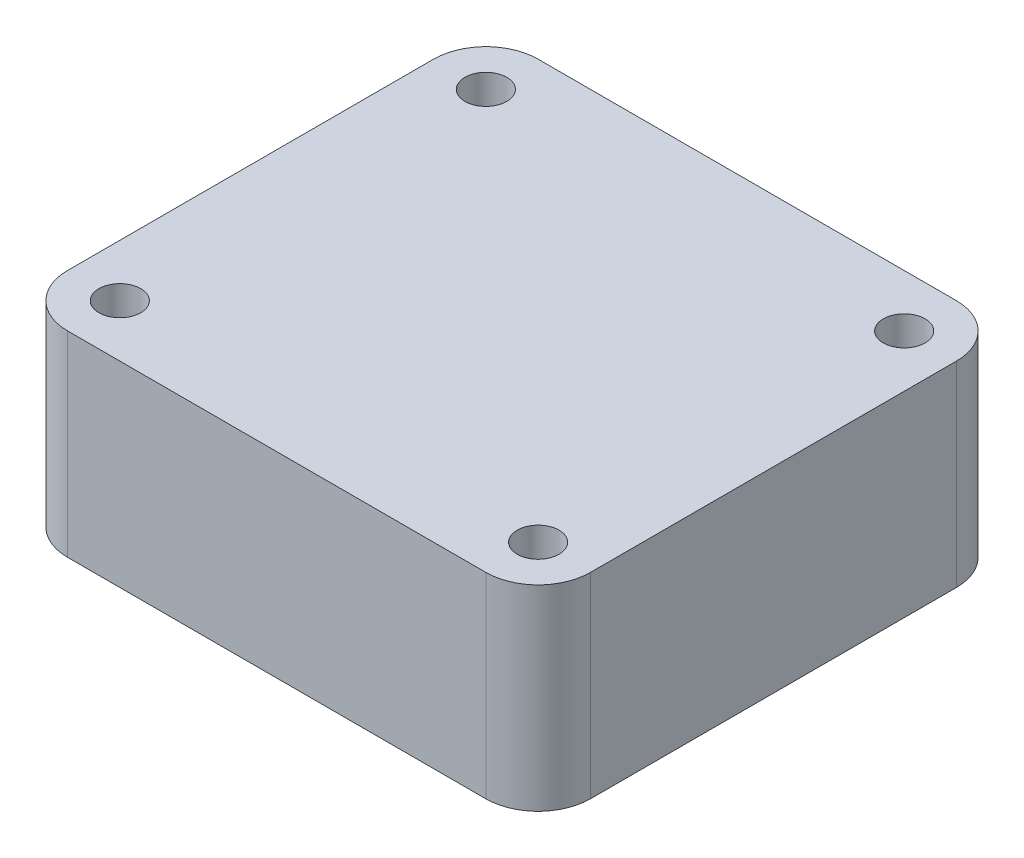
ISO-10303-21;
HEADER;
FILE_DESCRIPTION(('STEP AP214'),'2;1');
FILE_NAME('part.step','',(''),(''),'','','');
FILE_SCHEMA(('AUTOMOTIVE_DESIGN { 1 0 10303 214 1 1 1 1 }'));
ENDSEC;
DATA;
#1=APPLICATION_CONTEXT('core data for automotive mechanical design processes');
#2=APPLICATION_PROTOCOL_DEFINITION('international standard','automotive_design',2000,#1);
#3=PRODUCT_CONTEXT('',#1,'mechanical');
#4=PRODUCT('Part','Part','',(#3));
#5=PRODUCT_RELATED_PRODUCT_CATEGORY('part','',(#4));
#6=PRODUCT_DEFINITION_FORMATION('','',#4);
#7=PRODUCT_DEFINITION_CONTEXT('part definition',#1,'design');
#8=PRODUCT_DEFINITION('design','',#6,#7);
#9=PRODUCT_DEFINITION_SHAPE('','',#8);
#10=(LENGTH_UNIT() NAMED_UNIT(*) SI_UNIT(.MILLI.,.METRE.));
#11=(NAMED_UNIT(*) PLANE_ANGLE_UNIT() SI_UNIT($,.RADIAN.));
#12=(NAMED_UNIT(*) SI_UNIT($,.STERADIAN.) SOLID_ANGLE_UNIT());
#13=UNCERTAINTY_MEASURE_WITH_UNIT(LENGTH_MEASURE(1.E-05),#10,'distance_accuracy_value','');
#14=(GEOMETRIC_REPRESENTATION_CONTEXT(3) GLOBAL_UNCERTAINTY_ASSIGNED_CONTEXT((#13)) GLOBAL_UNIT_ASSIGNED_CONTEXT((#10,
#11,#12)) REPRESENTATION_CONTEXT('',''));
#15=CARTESIAN_POINT('',(0.,0.,0.));
#16=DIRECTION('',(0.,0.,1.));
#17=DIRECTION('',(1.,0.,0.));
#18=AXIS2_PLACEMENT_3D('',#15,#16,#17);
#19=CARTESIAN_POINT('',(-16.,15.,14.));
#20=DIRECTION('',(0.,-1.,0.));
#21=DIRECTION('',(0.,0.,-1.));
#22=AXIS2_PLACEMENT_3D('',#19,#20,#21);
#23=PLANE('',#22);
#24=CARTESIAN_POINT('',(-16.,15.,14.));
#25=DIRECTION('',(0.,1.,0.));
#26=DIRECTION('',(0.,0.,-1.));
#27=AXIS2_PLACEMENT_3D('',#24,#25,#26);
#28=CIRCLE('',#27,4.);
#29=CARTESIAN_POINT('',(-20.,15.,14.));
#30=VERTEX_POINT('',#29);
#31=CARTESIAN_POINT('',(-16.,15.,18.));
#32=VERTEX_POINT('',#31);
#33=EDGE_CURVE('E148',#30,#32,#28,.T.);
#34=ORIENTED_EDGE('',*,*,#33,.T.);
#35=DIRECTION('',(1.,0.,0.));
#36=VECTOR('',#35,1.);
#37=CARTESIAN_POINT('',(-16.,15.,18.));
#38=LINE('',#37,#36);
#39=CARTESIAN_POINT('',(16.,15.,18.));
#40=VERTEX_POINT('',#39);
#41=EDGE_CURVE('E96',#32,#40,#38,.T.);
#42=ORIENTED_EDGE('',*,*,#41,.T.);
#43=CARTESIAN_POINT('',(16.,15.,14.));
#44=DIRECTION('',(0.,1.,0.));
#45=DIRECTION('',(0.,0.,1.));
#46=AXIS2_PLACEMENT_3D('',#43,#44,#45);
#47=CIRCLE('',#46,4.);
#48=CARTESIAN_POINT('',(20.,15.,14.));
#49=VERTEX_POINT('',#48);
#50=EDGE_CURVE('E163',#40,#49,#47,.T.);
#51=ORIENTED_EDGE('',*,*,#50,.T.);
#52=DIRECTION('',(0.,0.,-1.));
#53=VECTOR('',#52,1.);
#54=CARTESIAN_POINT('',(20.,15.,14.));
#55=LINE('',#54,#53);
#56=CARTESIAN_POINT('',(20.,15.,-14.));
#57=VERTEX_POINT('',#56);
#58=EDGE_CURVE('E176',#49,#57,#55,.T.);
#59=ORIENTED_EDGE('',*,*,#58,.T.);
#60=CARTESIAN_POINT('',(16.,15.,-14.));
#61=DIRECTION('',(0.,1.,0.));
#62=DIRECTION('',(0.,0.,-1.));
#63=AXIS2_PLACEMENT_3D('',#60,#61,#62);
#64=CIRCLE('',#63,4.);
#65=CARTESIAN_POINT('',(16.,15.,-18.));
#66=VERTEX_POINT('',#65);
#67=EDGE_CURVE('E115',#57,#66,#64,.T.);
#68=ORIENTED_EDGE('',*,*,#67,.T.);
#69=DIRECTION('',(-1.,0.,0.));
#70=VECTOR('',#69,1.);
#71=CARTESIAN_POINT('',(-16.,15.,-18.));
#72=LINE('',#71,#70);
#73=CARTESIAN_POINT('',(-16.,15.,-18.));
#74=VERTEX_POINT('',#73);
#75=EDGE_CURVE('E109',#66,#74,#72,.T.);
#76=ORIENTED_EDGE('',*,*,#75,.T.);
#77=CARTESIAN_POINT('',(-16.,15.,-14.));
#78=DIRECTION('',(0.,1.,0.));
#79=DIRECTION('',(0.,0.,1.));
#80=AXIS2_PLACEMENT_3D('',#77,#78,#79);
#81=CIRCLE('',#80,4.);
#82=CARTESIAN_POINT('',(-20.,15.,-14.));
#83=VERTEX_POINT('',#82);
#84=EDGE_CURVE('E113',#74,#83,#81,.T.);
#85=ORIENTED_EDGE('',*,*,#84,.T.);
#86=DIRECTION('',(0.,0.,1.));
#87=VECTOR('',#86,1.);
#88=CARTESIAN_POINT('',(-20.,15.,14.));
#89=LINE('',#88,#87);
#90=EDGE_CURVE('E53',#83,#30,#89,.T.);
#91=ORIENTED_EDGE('',*,*,#90,.T.);
#92=EDGE_LOOP('',(#34,#42,#51,#59,#68,#76,#85,#91));
#93=FACE_BOUND('',#92,.T.);
#94=CARTESIAN_POINT('',(16.,15.,-14.));
#95=DIRECTION('',(0.,1.,0.));
#96=DIRECTION('',(0.,0.,1.));
#97=AXIS2_PLACEMENT_3D('',#94,#95,#96);
#98=CIRCLE('',#97,1.6);
#99=CARTESIAN_POINT('',(16.,15.,-12.4));
#100=VERTEX_POINT('',#99);
#101=EDGE_CURVE('E137',#100,#100,#98,.T.);
#102=ORIENTED_EDGE('',*,*,#101,.F.);
#103=EDGE_LOOP('',(#102));
#104=FACE_BOUND('',#103,.T.);
#105=CARTESIAN_POINT('',(-16.,15.,-14.));
#106=DIRECTION('',(0.,1.,0.));
#107=DIRECTION('',(0.,0.,1.));
#108=AXIS2_PLACEMENT_3D('',#105,#106,#107);
#109=CIRCLE('',#108,1.6);
#110=CARTESIAN_POINT('',(-16.,15.,-12.4));
#111=VERTEX_POINT('',#110);
#112=EDGE_CURVE('E185',#111,#111,#109,.T.);
#113=ORIENTED_EDGE('',*,*,#112,.F.);
#114=EDGE_LOOP('',(#113));
#115=FACE_BOUND('',#114,.T.);
#116=CARTESIAN_POINT('',(-16.,15.,14.));
#117=DIRECTION('',(0.,1.,0.));
#118=DIRECTION('',(0.,0.,1.));
#119=AXIS2_PLACEMENT_3D('',#116,#117,#118);
#120=CIRCLE('',#119,1.6);
#121=CARTESIAN_POINT('',(-16.,15.,15.6));
#122=VERTEX_POINT('',#121);
#123=EDGE_CURVE('E191',#122,#122,#120,.T.);
#124=ORIENTED_EDGE('',*,*,#123,.F.);
#125=EDGE_LOOP('',(#124));
#126=FACE_BOUND('',#125,.T.);
#127=CARTESIAN_POINT('',(16.,15.,14.));
#128=DIRECTION('',(0.,1.,0.));
#129=DIRECTION('',(0.,0.,1.));
#130=AXIS2_PLACEMENT_3D('',#127,#128,#129);
#131=CIRCLE('',#130,1.6);
#132=CARTESIAN_POINT('',(16.,15.,15.6));
#133=VERTEX_POINT('',#132);
#134=EDGE_CURVE('E197',#133,#133,#131,.T.);
#135=ORIENTED_EDGE('',*,*,#134,.F.);
#136=EDGE_LOOP('',(#135));
#137=FACE_BOUND('',#136,.T.);
#138=ADVANCED_FACE('F36',(#93,#104,#115,#126,#137),#23,.F.);
#139=CARTESIAN_POINT('',(-16.,0.,14.));
#140=DIRECTION('',(0.,-1.,0.));
#141=DIRECTION('',(0.,0.,-1.));
#142=AXIS2_PLACEMENT_3D('',#139,#140,#141);
#143=PLANE('',#142);
#144=CARTESIAN_POINT('',(-16.,0.,14.));
#145=DIRECTION('',(0.,1.,0.));
#146=DIRECTION('',(0.,0.,1.));
#147=AXIS2_PLACEMENT_3D('',#144,#145,#146);
#148=CIRCLE('',#147,1.6);
#149=CARTESIAN_POINT('',(-16.,0.,15.6));
#150=VERTEX_POINT('',#149);
#151=EDGE_CURVE('E194',#150,#150,#148,.T.);
#152=ORIENTED_EDGE('',*,*,#151,.T.);
#153=EDGE_LOOP('',(#152));
#154=FACE_BOUND('',#153,.T.);
#155=CARTESIAN_POINT('',(16.,0.,-14.));
#156=DIRECTION('',(0.,1.,0.));
#157=DIRECTION('',(0.,0.,1.));
#158=AXIS2_PLACEMENT_3D('',#155,#156,#157);
#159=CIRCLE('',#158,1.6);
#160=CARTESIAN_POINT('',(16.,0.,-12.4));
#161=VERTEX_POINT('',#160);
#162=EDGE_CURVE('E182',#161,#161,#159,.T.);
#163=ORIENTED_EDGE('',*,*,#162,.T.);
#164=EDGE_LOOP('',(#163));
#165=FACE_BOUND('',#164,.T.);
#166=CARTESIAN_POINT('',(-16.,0.,14.));
#167=DIRECTION('',(0.,1.,0.));
#168=DIRECTION('',(0.,0.,-1.));
#169=AXIS2_PLACEMENT_3D('',#166,#167,#168);
#170=CIRCLE('',#169,4.);
#171=CARTESIAN_POINT('',(-20.,0.,14.));
#172=VERTEX_POINT('',#171);
#173=CARTESIAN_POINT('',(-16.,0.,18.));
#174=VERTEX_POINT('',#173);
#175=EDGE_CURVE('E133',#172,#174,#170,.T.);
#176=ORIENTED_EDGE('',*,*,#175,.F.);
#177=DIRECTION('',(0.,0.,1.));
#178=VECTOR('',#177,1.);
#179=CARTESIAN_POINT('',(-20.,0.,14.));
#180=LINE('',#179,#178);
#181=CARTESIAN_POINT('',(-20.,0.,-14.));
#182=VERTEX_POINT('',#181);
#183=EDGE_CURVE('E88',#182,#172,#180,.T.);
#184=ORIENTED_EDGE('',*,*,#183,.F.);
#185=CARTESIAN_POINT('',(-16.,0.,-14.));
#186=DIRECTION('',(0.,1.,0.));
#187=DIRECTION('',(0.,0.,1.));
#188=AXIS2_PLACEMENT_3D('',#185,#186,#187);
#189=CIRCLE('',#188,4.);
#190=CARTESIAN_POINT('',(-16.,0.,-18.));
#191=VERTEX_POINT('',#190);
#192=EDGE_CURVE('E82',#191,#182,#189,.T.);
#193=ORIENTED_EDGE('',*,*,#192,.F.);
#194=DIRECTION('',(-1.,0.,0.));
#195=VECTOR('',#194,1.);
#196=CARTESIAN_POINT('',(-16.,0.,-18.));
#197=LINE('',#196,#195);
#198=CARTESIAN_POINT('',(16.,0.,-18.));
#199=VERTEX_POINT('',#198);
#200=EDGE_CURVE('E123',#199,#191,#197,.T.);
#201=ORIENTED_EDGE('',*,*,#200,.F.);
#202=CARTESIAN_POINT('',(16.,0.,-14.));
#203=DIRECTION('',(0.,1.,0.));
#204=DIRECTION('',(0.,0.,-1.));
#205=AXIS2_PLACEMENT_3D('',#202,#203,#204);
#206=CIRCLE('',#205,4.);
#207=CARTESIAN_POINT('',(20.,0.,-14.));
#208=VERTEX_POINT('',#207);
#209=EDGE_CURVE('E143',#208,#199,#206,.T.);
#210=ORIENTED_EDGE('',*,*,#209,.F.);
#211=DIRECTION('',(0.,0.,-1.));
#212=VECTOR('',#211,1.);
#213=CARTESIAN_POINT('',(20.,0.,14.));
#214=LINE('',#213,#212);
#215=CARTESIAN_POINT('',(20.,0.,14.));
#216=VERTEX_POINT('',#215);
#217=EDGE_CURVE('E141',#216,#208,#214,.T.);
#218=ORIENTED_EDGE('',*,*,#217,.F.);
#219=CARTESIAN_POINT('',(16.,0.,14.));
#220=DIRECTION('',(0.,1.,0.));
#221=DIRECTION('',(0.,0.,1.));
#222=AXIS2_PLACEMENT_3D('',#219,#220,#221);
#223=CIRCLE('',#222,4.);
#224=CARTESIAN_POINT('',(16.,0.,18.));
#225=VERTEX_POINT('',#224);
#226=EDGE_CURVE('E139',#225,#216,#223,.T.);
#227=ORIENTED_EDGE('',*,*,#226,.F.);
#228=DIRECTION('',(1.,0.,0.));
#229=VECTOR('',#228,1.);
#230=CARTESIAN_POINT('',(-16.,0.,18.));
#231=LINE('',#230,#229);
#232=EDGE_CURVE('E136',#174,#225,#231,.T.);
#233=ORIENTED_EDGE('',*,*,#232,.F.);
#234=EDGE_LOOP('',(#176,#184,#193,#201,#210,#218,#227,#233));
#235=FACE_BOUND('',#234,.T.);
#236=CARTESIAN_POINT('',(-16.,0.,-14.));
#237=DIRECTION('',(0.,1.,0.));
#238=DIRECTION('',(0.,0.,1.));
#239=AXIS2_PLACEMENT_3D('',#236,#237,#238);
#240=CIRCLE('',#239,1.6);
#241=CARTESIAN_POINT('',(-16.,0.,-12.4));
#242=VERTEX_POINT('',#241);
#243=EDGE_CURVE('E188',#242,#242,#240,.T.);
#244=ORIENTED_EDGE('',*,*,#243,.T.);
#245=EDGE_LOOP('',(#244));
#246=FACE_BOUND('',#245,.T.);
#247=CARTESIAN_POINT('',(16.,0.,14.));
#248=DIRECTION('',(0.,1.,0.));
#249=DIRECTION('',(0.,0.,1.));
#250=AXIS2_PLACEMENT_3D('',#247,#248,#249);
#251=CIRCLE('',#250,1.6);
#252=CARTESIAN_POINT('',(16.,0.,15.6));
#253=VERTEX_POINT('',#252);
#254=EDGE_CURVE('E200',#253,#253,#251,.T.);
#255=ORIENTED_EDGE('',*,*,#254,.T.);
#256=EDGE_LOOP('',(#255));
#257=FACE_BOUND('',#256,.T.);
#258=ADVANCED_FACE('F167',(#154,#165,#235,#246,#257),#143,.T.);
#259=CARTESIAN_POINT('',(-16.,15.,14.));
#260=DIRECTION('',(0.,-1.,0.));
#261=DIRECTION('',(0.,0.,-1.));
#262=AXIS2_PLACEMENT_3D('',#259,#260,#261);
#263=CYLINDRICAL_SURFACE('',#262,4.);
#264=ORIENTED_EDGE('',*,*,#175,.T.);
#265=DIRECTION('',(0.,-1.,0.));
#266=VECTOR('',#265,1.);
#267=CARTESIAN_POINT('',(-16.,15.,18.));
#268=LINE('',#267,#266);
#269=EDGE_CURVE('E11',#32,#174,#268,.T.);
#270=ORIENTED_EDGE('',*,*,#269,.F.);
#271=ORIENTED_EDGE('',*,*,#33,.F.);
#272=DIRECTION('',(0.,-1.,0.));
#273=VECTOR('',#272,1.);
#274=CARTESIAN_POINT('',(-20.,15.,14.));
#275=LINE('',#274,#273);
#276=EDGE_CURVE('E129',#30,#172,#275,.T.);
#277=ORIENTED_EDGE('',*,*,#276,.T.);
#278=EDGE_LOOP('',(#264,#270,#271,#277));
#279=FACE_BOUND('',#278,.T.);
#280=ADVANCED_FACE('F38',(#279),#263,.T.);
#281=CARTESIAN_POINT('',(-16.,15.,18.));
#282=DIRECTION('',(0.,0.,-1.));
#283=DIRECTION('',(-1.,0.,0.));
#284=AXIS2_PLACEMENT_3D('',#281,#282,#283);
#285=PLANE('',#284);
#286=ORIENTED_EDGE('',*,*,#232,.T.);
#287=DIRECTION('',(0.,-1.,0.));
#288=VECTOR('',#287,1.);
#289=CARTESIAN_POINT('',(16.,15.,18.));
#290=LINE('',#289,#288);
#291=EDGE_CURVE('E45',#40,#225,#290,.T.);
#292=ORIENTED_EDGE('',*,*,#291,.F.);
#293=ORIENTED_EDGE('',*,*,#41,.F.);
#294=ORIENTED_EDGE('',*,*,#269,.T.);
#295=EDGE_LOOP('',(#286,#292,#293,#294));
#296=FACE_BOUND('',#295,.T.);
#297=ADVANCED_FACE('F232',(#296),#285,.F.);
#298=CARTESIAN_POINT('',(16.,15.,14.));
#299=DIRECTION('',(0.,-1.,0.));
#300=DIRECTION('',(0.,0.,-1.));
#301=AXIS2_PLACEMENT_3D('',#298,#299,#300);
#302=CYLINDRICAL_SURFACE('',#301,4.);
#303=ORIENTED_EDGE('',*,*,#226,.T.);
#304=DIRECTION('',(0.,-1.,0.));
#305=VECTOR('',#304,1.);
#306=CARTESIAN_POINT('',(20.,15.,14.));
#307=LINE('',#306,#305);
#308=EDGE_CURVE('E155',#49,#216,#307,.T.);
#309=ORIENTED_EDGE('',*,*,#308,.F.);
#310=ORIENTED_EDGE('',*,*,#50,.F.);
#311=ORIENTED_EDGE('',*,*,#291,.T.);
#312=EDGE_LOOP('',(#303,#309,#310,#311));
#313=FACE_BOUND('',#312,.T.);
#314=ADVANCED_FACE('F161',(#313),#302,.T.);
#315=CARTESIAN_POINT('',(20.,15.,14.));
#316=DIRECTION('',(-1.,0.,0.));
#317=DIRECTION('',(0.,0.,1.));
#318=AXIS2_PLACEMENT_3D('',#315,#316,#317);
#319=PLANE('',#318);
#320=ORIENTED_EDGE('',*,*,#217,.T.);
#321=DIRECTION('',(0.,-1.,0.));
#322=VECTOR('',#321,1.);
#323=CARTESIAN_POINT('',(20.,15.,-14.));
#324=LINE('',#323,#322);
#325=EDGE_CURVE('E152',#57,#208,#324,.T.);
#326=ORIENTED_EDGE('',*,*,#325,.F.);
#327=ORIENTED_EDGE('',*,*,#58,.F.);
#328=ORIENTED_EDGE('',*,*,#308,.T.);
#329=EDGE_LOOP('',(#320,#326,#327,#328));
#330=FACE_BOUND('',#329,.T.);
#331=ADVANCED_FACE('F172',(#330),#319,.F.);
#332=CARTESIAN_POINT('',(16.,15.,-14.));
#333=DIRECTION('',(0.,-1.,0.));
#334=DIRECTION('',(0.,0.,-1.));
#335=AXIS2_PLACEMENT_3D('',#332,#333,#334);
#336=CYLINDRICAL_SURFACE('',#335,4.);
#337=ORIENTED_EDGE('',*,*,#209,.T.);
#338=DIRECTION('',(0.,-1.,0.));
#339=VECTOR('',#338,1.);
#340=CARTESIAN_POINT('',(16.,15.,-18.));
#341=LINE('',#340,#339);
#342=EDGE_CURVE('E124',#66,#199,#341,.T.);
#343=ORIENTED_EDGE('',*,*,#342,.F.);
#344=ORIENTED_EDGE('',*,*,#67,.F.);
#345=ORIENTED_EDGE('',*,*,#325,.T.);
#346=EDGE_LOOP('',(#337,#343,#344,#345));
#347=FACE_BOUND('',#346,.T.);
#348=ADVANCED_FACE('F175',(#347),#336,.T.);
#349=CARTESIAN_POINT('',(-16.,15.,-18.));
#350=DIRECTION('',(0.,0.,1.));
#351=DIRECTION('',(1.,0.,0.));
#352=AXIS2_PLACEMENT_3D('',#349,#350,#351);
#353=PLANE('',#352);
#354=ORIENTED_EDGE('',*,*,#200,.T.);
#355=DIRECTION('',(0.,-1.,0.));
#356=VECTOR('',#355,1.);
#357=CARTESIAN_POINT('',(-16.,15.,-18.));
#358=LINE('',#357,#356);
#359=EDGE_CURVE('E120',#74,#191,#358,.T.);
#360=ORIENTED_EDGE('',*,*,#359,.F.);
#361=ORIENTED_EDGE('',*,*,#75,.F.);
#362=ORIENTED_EDGE('',*,*,#342,.T.);
#363=EDGE_LOOP('',(#354,#360,#361,#362));
#364=FACE_BOUND('',#363,.T.);
#365=ADVANCED_FACE('F121',(#364),#353,.F.);
#366=CARTESIAN_POINT('',(-16.,15.,-14.));
#367=DIRECTION('',(0.,-1.,0.));
#368=DIRECTION('',(0.,0.,-1.));
#369=AXIS2_PLACEMENT_3D('',#366,#367,#368);
#370=CYLINDRICAL_SURFACE('',#369,4.);
#371=ORIENTED_EDGE('',*,*,#192,.T.);
#372=DIRECTION('',(0.,-1.,0.));
#373=VECTOR('',#372,1.);
#374=CARTESIAN_POINT('',(-20.,15.,-14.));
#375=LINE('',#374,#373);
#376=EDGE_CURVE('E125',#83,#182,#375,.T.);
#377=ORIENTED_EDGE('',*,*,#376,.F.);
#378=ORIENTED_EDGE('',*,*,#84,.F.);
#379=ORIENTED_EDGE('',*,*,#359,.T.);
#380=EDGE_LOOP('',(#371,#377,#378,#379));
#381=FACE_BOUND('',#380,.T.);
#382=ADVANCED_FACE('F127',(#381),#370,.T.);
#383=CARTESIAN_POINT('',(-20.,15.,14.));
#384=DIRECTION('',(1.,0.,0.));
#385=DIRECTION('',(0.,0.,-1.));
#386=AXIS2_PLACEMENT_3D('',#383,#384,#385);
#387=PLANE('',#386);
#388=ORIENTED_EDGE('',*,*,#183,.T.);
#389=ORIENTED_EDGE('',*,*,#276,.F.);
#390=ORIENTED_EDGE('',*,*,#90,.F.);
#391=ORIENTED_EDGE('',*,*,#376,.T.);
#392=EDGE_LOOP('',(#388,#389,#390,#391));
#393=FACE_BOUND('',#392,.T.);
#394=ADVANCED_FACE('F220',(#393),#387,.F.);
#395=CARTESIAN_POINT('',(16.,15.,-14.));
#396=DIRECTION('',(0.,-1.,0.));
#397=DIRECTION('',(0.,0.,-1.));
#398=AXIS2_PLACEMENT_3D('',#395,#396,#397);
#399=CYLINDRICAL_SURFACE('',#398,1.6);
#400=ORIENTED_EDGE('',*,*,#101,.T.);
#401=EDGE_LOOP('',(#400));
#402=FACE_BOUND('',#401,.T.);
#403=ORIENTED_EDGE('',*,*,#162,.F.);
#404=EDGE_LOOP('',(#403));
#405=FACE_BOUND('',#404,.T.);
#406=ADVANCED_FACE('F217',(#402,#405),#399,.F.);
#407=CARTESIAN_POINT('',(-16.,15.,-14.));
#408=DIRECTION('',(0.,-1.,0.));
#409=DIRECTION('',(0.,0.,-1.));
#410=AXIS2_PLACEMENT_3D('',#407,#408,#409);
#411=CYLINDRICAL_SURFACE('',#410,1.6);
#412=ORIENTED_EDGE('',*,*,#112,.T.);
#413=EDGE_LOOP('',(#412));
#414=FACE_BOUND('',#413,.T.);
#415=ORIENTED_EDGE('',*,*,#243,.F.);
#416=EDGE_LOOP('',(#415));
#417=FACE_BOUND('',#416,.T.);
#418=ADVANCED_FACE('F296',(#414,#417),#411,.F.);
#419=CARTESIAN_POINT('',(-16.,15.,14.));
#420=DIRECTION('',(0.,-1.,0.));
#421=DIRECTION('',(0.,0.,-1.));
#422=AXIS2_PLACEMENT_3D('',#419,#420,#421);
#423=CYLINDRICAL_SURFACE('',#422,1.6);
#424=ORIENTED_EDGE('',*,*,#123,.T.);
#425=EDGE_LOOP('',(#424));
#426=FACE_BOUND('',#425,.T.);
#427=ORIENTED_EDGE('',*,*,#151,.F.);
#428=EDGE_LOOP('',(#427));
#429=FACE_BOUND('',#428,.T.);
#430=ADVANCED_FACE('F304',(#426,#429),#423,.F.);
#431=CARTESIAN_POINT('',(16.,15.,14.));
#432=DIRECTION('',(0.,-1.,0.));
#433=DIRECTION('',(0.,0.,-1.));
#434=AXIS2_PLACEMENT_3D('',#431,#432,#433);
#435=CYLINDRICAL_SURFACE('',#434,1.6);
#436=ORIENTED_EDGE('',*,*,#134,.T.);
#437=EDGE_LOOP('',(#436));
#438=FACE_BOUND('',#437,.T.);
#439=ORIENTED_EDGE('',*,*,#254,.F.);
#440=EDGE_LOOP('',(#439));
#441=FACE_BOUND('',#440,.T.);
#442=ADVANCED_FACE('F206',(#438,#441),#435,.F.);
#443=CLOSED_SHELL('',(#138,#258,#280,#297,#314,#331,#348,#365,#382,#394,#406,#418,#430,#442));
#444=MANIFOLD_SOLID_BREP('B2',#443);
#445=ADVANCED_BREP_SHAPE_REPRESENTATION('',(#18,#444),#14);
#446=SHAPE_DEFINITION_REPRESENTATION(#9,#445);
ENDSEC;
END-ISO-10303-21;
